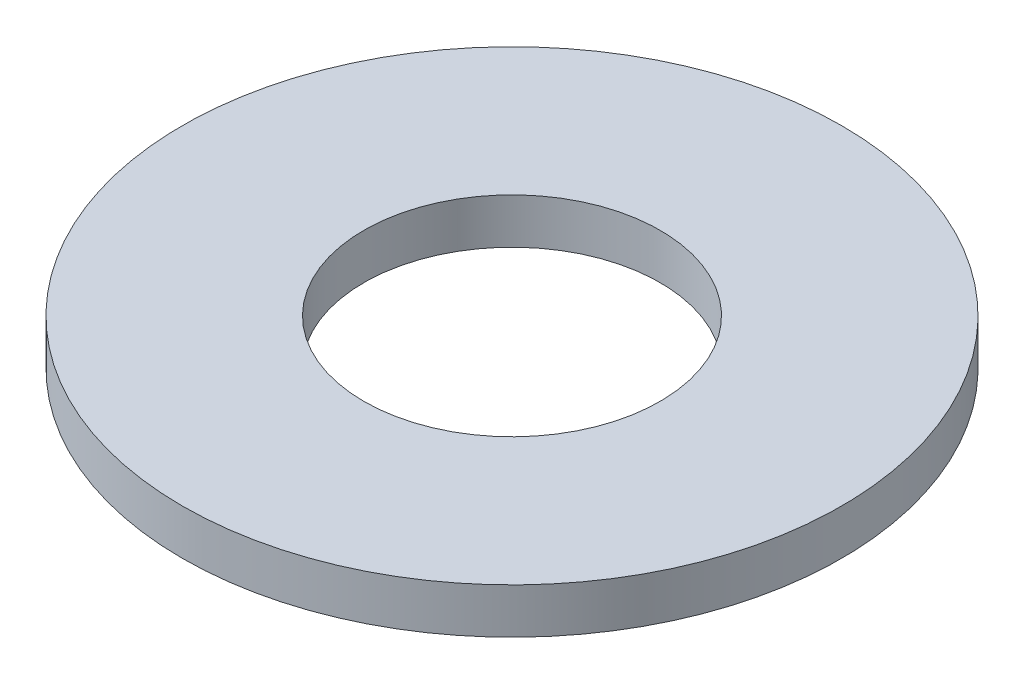
ISO-10303-21;
HEADER;
FILE_DESCRIPTION(('STEP AP214'),'2;1');
FILE_NAME('part.step','',(''),(''),'','','');
FILE_SCHEMA(('AUTOMOTIVE_DESIGN { 1 0 10303 214 1 1 1 1 }'));
ENDSEC;
DATA;
#1=APPLICATION_CONTEXT('core data for automotive mechanical design processes');
#2=APPLICATION_PROTOCOL_DEFINITION('international standard','automotive_design',2000,#1);
#3=PRODUCT_CONTEXT('',#1,'mechanical');
#4=PRODUCT('Part','Part','',(#3));
#5=PRODUCT_RELATED_PRODUCT_CATEGORY('part','',(#4));
#6=PRODUCT_DEFINITION_FORMATION('','',#4);
#7=PRODUCT_DEFINITION_CONTEXT('part definition',#1,'design');
#8=PRODUCT_DEFINITION('design','',#6,#7);
#9=PRODUCT_DEFINITION_SHAPE('','',#8);
#10=(LENGTH_UNIT() NAMED_UNIT(*) SI_UNIT(.MILLI.,.METRE.));
#11=(NAMED_UNIT(*) PLANE_ANGLE_UNIT() SI_UNIT($,.RADIAN.));
#12=(NAMED_UNIT(*) SI_UNIT($,.STERADIAN.) SOLID_ANGLE_UNIT());
#13=UNCERTAINTY_MEASURE_WITH_UNIT(LENGTH_MEASURE(1.E-05),#10,'distance_accuracy_value','');
#14=(GEOMETRIC_REPRESENTATION_CONTEXT(3) GLOBAL_UNCERTAINTY_ASSIGNED_CONTEXT((#13)) GLOBAL_UNIT_ASSIGNED_CONTEXT((#10,
#11,#12)) REPRESENTATION_CONTEXT('',''));
#15=CARTESIAN_POINT('',(0.,0.,0.));
#16=DIRECTION('',(0.,0.,1.));
#17=DIRECTION('',(1.,0.,0.));
#18=AXIS2_PLACEMENT_3D('',#15,#16,#17);
#19=CARTESIAN_POINT('',(0.,1.0922,0.));
#20=DIRECTION('',(0.,-1.,0.));
#21=DIRECTION('',(0.,0.,-1.));
#22=AXIS2_PLACEMENT_3D('',#19,#20,#21);
#23=CYLINDRICAL_SURFACE('',#22,7.9375);
#24=CARTESIAN_POINT('',(0.,1.0922,0.));
#25=DIRECTION('',(0.,1.,0.));
#26=DIRECTION('',(0.,0.,1.));
#27=AXIS2_PLACEMENT_3D('',#24,#25,#26);
#28=CIRCLE('',#27,7.9375);
#29=CARTESIAN_POINT('',(0.,1.0922,7.9375));
#30=VERTEX_POINT('',#29);
#31=EDGE_CURVE('E10',#30,#30,#28,.T.);
#32=ORIENTED_EDGE('',*,*,#31,.F.);
#33=EDGE_LOOP('',(#32));
#34=FACE_BOUND('',#33,.T.);
#35=CARTESIAN_POINT('',(0.,0.,0.));
#36=DIRECTION('',(0.,1.,0.));
#37=DIRECTION('',(0.,0.,1.));
#38=AXIS2_PLACEMENT_3D('',#35,#36,#37);
#39=CIRCLE('',#38,7.9375);
#40=CARTESIAN_POINT('',(0.,0.,7.9375));
#41=VERTEX_POINT('',#40);
#42=EDGE_CURVE('E38',#41,#41,#39,.T.);
#43=ORIENTED_EDGE('',*,*,#42,.T.);
#44=EDGE_LOOP('',(#43));
#45=FACE_BOUND('',#44,.T.);
#46=ADVANCED_FACE('F35',(#34,#45),#23,.T.);
#47=CARTESIAN_POINT('',(0.,1.0922,0.));
#48=DIRECTION('',(0.,1.,0.));
#49=DIRECTION('',(0.,0.,1.));
#50=AXIS2_PLACEMENT_3D('',#47,#48,#49);
#51=PLANE('',#50);
#52=CARTESIAN_POINT('',(0.,1.0922,0.));
#53=DIRECTION('',(0.,1.,0.));
#54=DIRECTION('',(0.,0.,1.));
#55=AXIS2_PLACEMENT_3D('',#52,#53,#54);
#56=CIRCLE('',#55,3.5687);
#57=CARTESIAN_POINT('',(0.,1.0922,3.5687));
#58=VERTEX_POINT('',#57);
#59=EDGE_CURVE('E47',#58,#58,#56,.T.);
#60=ORIENTED_EDGE('',*,*,#59,.F.);
#61=EDGE_LOOP('',(#60));
#62=FACE_BOUND('',#61,.T.);
#63=ORIENTED_EDGE('',*,*,#31,.T.);
#64=EDGE_LOOP('',(#63));
#65=FACE_BOUND('',#64,.T.);
#66=ADVANCED_FACE('F62',(#62,#65),#51,.T.);
#67=CARTESIAN_POINT('',(0.,0.,0.));
#68=DIRECTION('',(0.,1.,0.));
#69=DIRECTION('',(0.,0.,1.));
#70=AXIS2_PLACEMENT_3D('',#67,#68,#69);
#71=PLANE('',#70);
#72=CARTESIAN_POINT('',(0.,0.,0.));
#73=DIRECTION('',(0.,1.,0.));
#74=DIRECTION('',(0.,0.,1.));
#75=AXIS2_PLACEMENT_3D('',#72,#73,#74);
#76=CIRCLE('',#75,3.5687);
#77=CARTESIAN_POINT('',(0.,0.,3.5687));
#78=VERTEX_POINT('',#77);
#79=EDGE_CURVE('E45',#78,#78,#76,.T.);
#80=ORIENTED_EDGE('',*,*,#79,.T.);
#81=EDGE_LOOP('',(#80));
#82=FACE_BOUND('',#81,.T.);
#83=ORIENTED_EDGE('',*,*,#42,.F.);
#84=EDGE_LOOP('',(#83));
#85=FACE_BOUND('',#84,.T.);
#86=ADVANCED_FACE('F53',(#82,#85),#71,.F.);
#87=CARTESIAN_POINT('',(0.,0.,0.));
#88=DIRECTION('',(0.,1.,0.));
#89=DIRECTION('',(0.,0.,1.));
#90=AXIS2_PLACEMENT_3D('',#87,#88,#89);
#91=CYLINDRICAL_SURFACE('',#90,3.5687);
#92=ORIENTED_EDGE('',*,*,#79,.F.);
#93=EDGE_LOOP('',(#92));
#94=FACE_BOUND('',#93,.T.);
#95=ORIENTED_EDGE('',*,*,#59,.T.);
#96=EDGE_LOOP('',(#95));
#97=FACE_BOUND('',#96,.T.);
#98=ADVANCED_FACE('F56',(#94,#97),#91,.F.);
#99=CLOSED_SHELL('',(#46,#66,#86,#98));
#100=MANIFOLD_SOLID_BREP('B2',#99);
#101=ADVANCED_BREP_SHAPE_REPRESENTATION('',(#18,#100),#14);
#102=SHAPE_DEFINITION_REPRESENTATION(#9,#101);
ENDSEC;
END-ISO-10303-21;
